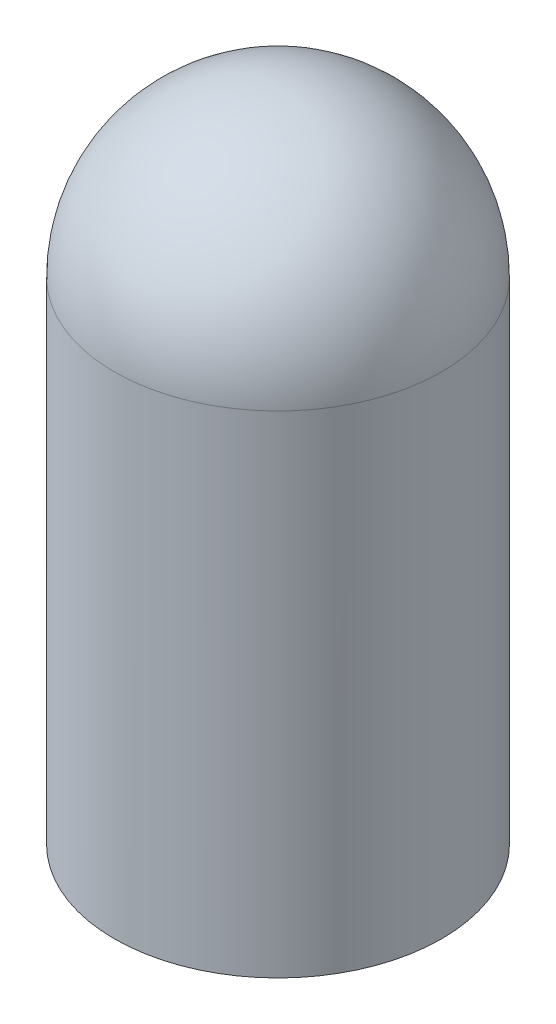
ISO-10303-21;
HEADER;
FILE_DESCRIPTION(('STEP AP214'),'2;1');
FILE_NAME('part.step','',(''),(''),'','','');
FILE_SCHEMA(('AUTOMOTIVE_DESIGN { 1 0 10303 214 1 1 1 1 }'));
ENDSEC;
DATA;
#1=APPLICATION_CONTEXT('core data for automotive mechanical design processes');
#2=APPLICATION_PROTOCOL_DEFINITION('international standard','automotive_design',2000,#1);
#3=PRODUCT_CONTEXT('',#1,'mechanical');
#4=PRODUCT('Part','Part','',(#3));
#5=PRODUCT_RELATED_PRODUCT_CATEGORY('part','',(#4));
#6=PRODUCT_DEFINITION_FORMATION('','',#4);
#7=PRODUCT_DEFINITION_CONTEXT('part definition',#1,'design');
#8=PRODUCT_DEFINITION('design','',#6,#7);
#9=PRODUCT_DEFINITION_SHAPE('','',#8);
#10=(LENGTH_UNIT() NAMED_UNIT(*) SI_UNIT(.MILLI.,.METRE.));
#11=(NAMED_UNIT(*) PLANE_ANGLE_UNIT() SI_UNIT($,.RADIAN.));
#12=(NAMED_UNIT(*) SI_UNIT($,.STERADIAN.) SOLID_ANGLE_UNIT());
#13=UNCERTAINTY_MEASURE_WITH_UNIT(LENGTH_MEASURE(1.E-05),#10,'distance_accuracy_value','');
#14=(GEOMETRIC_REPRESENTATION_CONTEXT(3) GLOBAL_UNCERTAINTY_ASSIGNED_CONTEXT((#13)) GLOBAL_UNIT_ASSIGNED_CONTEXT((#10,
#11,#12)) REPRESENTATION_CONTEXT('',''));
#15=CARTESIAN_POINT('',(0.,0.,0.));
#16=DIRECTION('',(0.,0.,1.));
#17=DIRECTION('',(1.,0.,0.));
#18=AXIS2_PLACEMENT_3D('',#15,#16,#17);
#19=CARTESIAN_POINT('',(0.,9.652,0.));
#20=DIRECTION('',(0.,-1.,0.));
#21=DIRECTION('',(0.,0.,-1.));
#22=AXIS2_PLACEMENT_3D('',#19,#20,#21);
#23=CYLINDRICAL_SURFACE('',#22,2.413);
#24=CARTESIAN_POINT('',(0.,7.239,0.));
#25=DIRECTION('',(0.,-1.,0.));
#26=DIRECTION('',(0.,0.,-1.));
#27=AXIS2_PLACEMENT_3D('',#24,#25,#26);
#28=CIRCLE('',#27,2.413);
#29=CARTESIAN_POINT('',(0.,7.239,-2.413));
#30=VERTEX_POINT('',#29);
#31=EDGE_CURVE('E10',#30,#30,#28,.T.);
#32=ORIENTED_EDGE('',*,*,#31,.T.);
#33=EDGE_LOOP('',(#32));
#34=FACE_BOUND('',#33,.T.);
#35=CARTESIAN_POINT('',(0.,0.,0.));
#36=DIRECTION('',(0.,1.,0.));
#37=DIRECTION('',(0.,0.,1.));
#38=AXIS2_PLACEMENT_3D('',#35,#36,#37);
#39=CIRCLE('',#38,2.413);
#40=CARTESIAN_POINT('',(0.,0.,2.413));
#41=VERTEX_POINT('',#40);
#42=EDGE_CURVE('E36',#41,#41,#39,.T.);
#43=ORIENTED_EDGE('',*,*,#42,.T.);
#44=EDGE_LOOP('',(#43));
#45=FACE_BOUND('',#44,.T.);
#46=ADVANCED_FACE('F29',(#34,#45),#23,.T.);
#47=CARTESIAN_POINT('',(0.,0.,0.));
#48=DIRECTION('',(0.,1.,0.));
#49=DIRECTION('',(0.,0.,1.));
#50=AXIS2_PLACEMENT_3D('',#47,#48,#49);
#51=PLANE('',#50);
#52=ORIENTED_EDGE('',*,*,#42,.F.);
#53=EDGE_LOOP('',(#52));
#54=FACE_BOUND('',#53,.T.);
#55=ADVANCED_FACE('F43',(#54),#51,.F.);
#56=CARTESIAN_POINT('',(0.,7.239,0.));
#57=DIRECTION('',(0.,0.,1.));
#58=DIRECTION('',(1.,0.,0.));
#59=AXIS2_PLACEMENT_3D('',#56,#57,#58);
#60=SPHERICAL_SURFACE('',#59,2.413);
#61=CARTESIAN_POINT('',(0.,7.239,0.));
#62=DIRECTION('',(0.,-1.,0.));
#63=DIRECTION('',(0.,0.,-1.));
#64=AXIS2_PLACEMENT_3D('',#61,#62,#63);
#65=SPHERICAL_SURFACE('',#64,2.413);
#66=ORIENTED_EDGE('',*,*,#31,.F.);
#67=EDGE_LOOP('',(#66));
#68=FACE_BOUND('',#67,.T.);
#69=ADVANCED_FACE('F31',(#68),#65,.T.);
#70=CLOSED_SHELL('',(#46,#55,#69));
#71=MANIFOLD_SOLID_BREP('B2',#70);
#72=ADVANCED_BREP_SHAPE_REPRESENTATION('',(#18,#71),#14);
#73=SHAPE_DEFINITION_REPRESENTATION(#9,#72);
ENDSEC;
END-ISO-10303-21;
